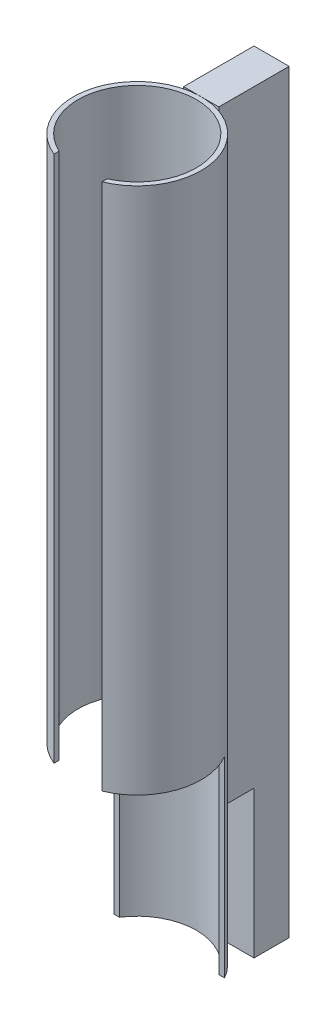
ISO-10303-21;
HEADER;
FILE_DESCRIPTION(('STEP AP214'),'2;1');
FILE_NAME('part.step','',(''),(''),'','','');
FILE_SCHEMA(('AUTOMOTIVE_DESIGN { 1 0 10303 214 1 1 1 1 }'));
ENDSEC;
DATA;
#1=APPLICATION_CONTEXT('core data for automotive mechanical design processes');
#2=APPLICATION_PROTOCOL_DEFINITION('international standard','automotive_design',2000,#1);
#3=PRODUCT_CONTEXT('',#1,'mechanical');
#4=PRODUCT('Part','Part','',(#3));
#5=PRODUCT_RELATED_PRODUCT_CATEGORY('part','',(#4));
#6=PRODUCT_DEFINITION_FORMATION('','',#4);
#7=PRODUCT_DEFINITION_CONTEXT('part definition',#1,'design');
#8=PRODUCT_DEFINITION('design','',#6,#7);
#9=PRODUCT_DEFINITION_SHAPE('','',#8);
#10=(LENGTH_UNIT() NAMED_UNIT(*) SI_UNIT(.MILLI.,.METRE.));
#11=(NAMED_UNIT(*) PLANE_ANGLE_UNIT() SI_UNIT($,.RADIAN.));
#12=(NAMED_UNIT(*) SI_UNIT($,.STERADIAN.) SOLID_ANGLE_UNIT());
#13=UNCERTAINTY_MEASURE_WITH_UNIT(LENGTH_MEASURE(1.E-05),#10,'distance_accuracy_value','');
#14=(GEOMETRIC_REPRESENTATION_CONTEXT(3) GLOBAL_UNCERTAINTY_ASSIGNED_CONTEXT((#13)) GLOBAL_UNIT_ASSIGNED_CONTEXT((#10,
#11,#12)) REPRESENTATION_CONTEXT('',''));
#15=CARTESIAN_POINT('',(0.,0.,0.));
#16=DIRECTION('',(0.,0.,1.));
#17=DIRECTION('',(1.,0.,0.));
#18=AXIS2_PLACEMENT_3D('',#15,#16,#17);
#19=CARTESIAN_POINT('',(11.,70.,-62.));
#20=DIRECTION('',(0.,0.,-1.));
#21=DIRECTION('',(0.,1.,0.));
#22=AXIS2_PLACEMENT_3D('',#19,#20,#21);
#23=PLANE('',#22);
#24=DIRECTION('',(0.,-1.,0.));
#25=VECTOR('',#24,1.);
#26=CARTESIAN_POINT('',(-11.,70.,-62.));
#27=LINE('',#26,#25);
#28=CARTESIAN_POINT('',(-11.,70.,-62.));
#29=VERTEX_POINT('',#28);
#30=CARTESIAN_POINT('',(-11.,-22.,-62.0000000000001));
#31=VERTEX_POINT('',#30);
#32=EDGE_CURVE('E126',#29,#31,#27,.T.);
#33=ORIENTED_EDGE('',*,*,#32,.T.);
#34=DIRECTION('',(-1.,0.,0.));
#35=VECTOR('',#34,1.);
#36=CARTESIAN_POINT('',(11.,-22.,-62.0000000000001));
#37=LINE('',#36,#35);
#38=CARTESIAN_POINT('',(11.,-22.,-62.0000000000001));
#39=VERTEX_POINT('',#38);
#40=EDGE_CURVE('E12',#39,#31,#37,.T.);
#41=ORIENTED_EDGE('',*,*,#40,.F.);
#42=DIRECTION('',(0.,-1.,0.));
#43=VECTOR('',#42,1.);
#44=CARTESIAN_POINT('',(11.,70.,-62.));
#45=LINE('',#44,#43);
#46=CARTESIAN_POINT('',(11.,70.,-62.));
#47=VERTEX_POINT('',#46);
#48=EDGE_CURVE('E136',#47,#39,#45,.T.);
#49=ORIENTED_EDGE('',*,*,#48,.F.);
#50=DIRECTION('',(-1.,0.,0.));
#51=VECTOR('',#50,1.);
#52=CARTESIAN_POINT('',(11.,70.,-62.));
#53=LINE('',#52,#51);
#54=EDGE_CURVE('E122',#47,#29,#53,.T.);
#55=ORIENTED_EDGE('',*,*,#54,.T.);
#56=EDGE_LOOP('',(#33,#41,#49,#55));
#57=FACE_BOUND('',#56,.T.);
#58=ADVANCED_FACE('F42',(#57),#23,.F.);
#59=CARTESIAN_POINT('',(11.,-22.,-62.0000000000001));
#60=DIRECTION('',(0.,1.,0.));
#61=DIRECTION('',(0.,0.,1.));
#62=AXIS2_PLACEMENT_3D('',#59,#60,#61);
#63=PLANE('',#62);
#64=DIRECTION('',(0.,0.,-1.));
#65=VECTOR('',#64,1.);
#66=CARTESIAN_POINT('',(-11.,-22.,-62.0000000000001));
#67=LINE('',#66,#65);
#68=CARTESIAN_POINT('',(-11.,-22.,-84.));
#69=VERTEX_POINT('',#68);
#70=EDGE_CURVE('E129',#31,#69,#67,.T.);
#71=ORIENTED_EDGE('',*,*,#70,.T.);
#72=DIRECTION('',(-1.,0.,0.));
#73=VECTOR('',#72,1.);
#74=CARTESIAN_POINT('',(11.,-22.,-84.));
#75=LINE('',#74,#73);
#76=CARTESIAN_POINT('',(11.,-22.,-84.));
#77=VERTEX_POINT('',#76);
#78=EDGE_CURVE('E50',#77,#69,#75,.T.);
#79=ORIENTED_EDGE('',*,*,#78,.F.);
#80=DIRECTION('',(0.,0.,-1.));
#81=VECTOR('',#80,1.);
#82=CARTESIAN_POINT('',(11.,-22.,-62.0000000000001));
#83=LINE('',#82,#81);
#84=EDGE_CURVE('E95',#39,#77,#83,.T.);
#85=ORIENTED_EDGE('',*,*,#84,.F.);
#86=ORIENTED_EDGE('',*,*,#40,.T.);
#87=EDGE_LOOP('',(#71,#79,#85,#86));
#88=FACE_BOUND('',#87,.T.);
#89=ADVANCED_FACE('F160',(#88),#63,.F.);
#90=CARTESIAN_POINT('',(11.,-22.,-84.));
#91=DIRECTION('',(0.,0.,1.));
#92=DIRECTION('',(1.,0.,0.));
#93=AXIS2_PLACEMENT_3D('',#90,#91,#92);
#94=PLANE('',#93);
#95=DIRECTION('',(0.,1.,0.));
#96=VECTOR('',#95,1.);
#97=CARTESIAN_POINT('',(-11.,-22.,-84.));
#98=LINE('',#97,#96);
#99=CARTESIAN_POINT('',(-11.,450.,-84.));
#100=VERTEX_POINT('',#99);
#101=EDGE_CURVE('E131',#69,#100,#98,.T.);
#102=ORIENTED_EDGE('',*,*,#101,.T.);
#103=DIRECTION('',(-1.,0.,0.));
#104=VECTOR('',#103,1.);
#105=CARTESIAN_POINT('',(11.,450.,-84.));
#106=LINE('',#105,#104);
#107=CARTESIAN_POINT('',(11.,450.,-84.));
#108=VERTEX_POINT('',#107);
#109=EDGE_CURVE('E117',#108,#100,#106,.T.);
#110=ORIENTED_EDGE('',*,*,#109,.F.);
#111=DIRECTION('',(0.,1.,0.));
#112=VECTOR('',#111,1.);
#113=CARTESIAN_POINT('',(11.,-22.,-84.));
#114=LINE('',#113,#112);
#115=EDGE_CURVE('E108',#77,#108,#114,.T.);
#116=ORIENTED_EDGE('',*,*,#115,.F.);
#117=ORIENTED_EDGE('',*,*,#78,.T.);
#118=EDGE_LOOP('',(#102,#110,#116,#117));
#119=FACE_BOUND('',#118,.T.);
#120=ADVANCED_FACE('F142',(#119),#94,.F.);
#121=CARTESIAN_POINT('',(11.,450.,-84.));
#122=DIRECTION('',(0.,-1.,0.));
#123=DIRECTION('',(0.,0.,-1.));
#124=AXIS2_PLACEMENT_3D('',#121,#122,#123);
#125=PLANE('',#124);
#126=DIRECTION('',(0.,0.,1.));
#127=VECTOR('',#126,1.);
#128=CARTESIAN_POINT('',(-11.,450.,-84.));
#129=LINE('',#128,#127);
#130=CARTESIAN_POINT('',(-11.,450.,-40.));
#131=VERTEX_POINT('',#130);
#132=EDGE_CURVE('E116',#100,#131,#129,.T.);
#133=ORIENTED_EDGE('',*,*,#132,.T.);
#134=DIRECTION('',(-1.,0.,0.));
#135=VECTOR('',#134,1.);
#136=CARTESIAN_POINT('',(11.,450.,-40.));
#137=LINE('',#136,#135);
#138=CARTESIAN_POINT('',(11.,450.,-40.));
#139=VERTEX_POINT('',#138);
#140=EDGE_CURVE('E113',#139,#131,#137,.T.);
#141=ORIENTED_EDGE('',*,*,#140,.F.);
#142=DIRECTION('',(0.,0.,1.));
#143=VECTOR('',#142,1.);
#144=CARTESIAN_POINT('',(11.,450.,-84.));
#145=LINE('',#144,#143);
#146=EDGE_CURVE('E102',#108,#139,#145,.T.);
#147=ORIENTED_EDGE('',*,*,#146,.F.);
#148=ORIENTED_EDGE('',*,*,#109,.T.);
#149=EDGE_LOOP('',(#133,#141,#147,#148));
#150=FACE_BOUND('',#149,.T.);
#151=ADVANCED_FACE('F114',(#150),#125,.F.);
#152=CARTESIAN_POINT('',(11.,450.,-40.));
#153=DIRECTION('',(0.,0.,-1.));
#154=DIRECTION('',(0.,1.,0.));
#155=AXIS2_PLACEMENT_3D('',#152,#153,#154);
#156=PLANE('',#155);
#157=DIRECTION('',(0.,-1.,0.));
#158=VECTOR('',#157,1.);
#159=CARTESIAN_POINT('',(-11.,450.,-40.));
#160=LINE('',#159,#158);
#161=CARTESIAN_POINT('',(-11.,70.,-40.));
#162=VERTEX_POINT('',#161);
#163=EDGE_CURVE('E81',#131,#162,#160,.T.);
#164=ORIENTED_EDGE('',*,*,#163,.T.);
#165=DIRECTION('',(-1.,0.,0.));
#166=VECTOR('',#165,1.);
#167=CARTESIAN_POINT('',(11.,70.,-40.));
#168=LINE('',#167,#166);
#169=CARTESIAN_POINT('',(11.,70.,-40.));
#170=VERTEX_POINT('',#169);
#171=EDGE_CURVE('E118',#170,#162,#168,.T.);
#172=ORIENTED_EDGE('',*,*,#171,.F.);
#173=DIRECTION('',(0.,-1.,0.));
#174=VECTOR('',#173,1.);
#175=CARTESIAN_POINT('',(11.,450.,-40.));
#176=LINE('',#175,#174);
#177=EDGE_CURVE('E106',#139,#170,#176,.T.);
#178=ORIENTED_EDGE('',*,*,#177,.F.);
#179=ORIENTED_EDGE('',*,*,#140,.T.);
#180=EDGE_LOOP('',(#164,#172,#178,#179));
#181=FACE_BOUND('',#180,.T.);
#182=ADVANCED_FACE('F120',(#181),#156,.F.);
#183=CARTESIAN_POINT('',(11.,70.,-40.));
#184=DIRECTION('',(0.,1.,0.));
#185=DIRECTION('',(0.,0.,1.));
#186=AXIS2_PLACEMENT_3D('',#183,#184,#185);
#187=PLANE('',#186);
#188=DIRECTION('',(0.,0.,-1.));
#189=VECTOR('',#188,1.);
#190=CARTESIAN_POINT('',(-11.,70.,-40.));
#191=LINE('',#190,#189);
#192=EDGE_CURVE('E87',#162,#29,#191,.T.);
#193=ORIENTED_EDGE('',*,*,#192,.T.);
#194=ORIENTED_EDGE('',*,*,#54,.F.);
#195=DIRECTION('',(0.,0.,-1.));
#196=VECTOR('',#195,1.);
#197=CARTESIAN_POINT('',(11.,70.,-40.));
#198=LINE('',#197,#196);
#199=EDGE_CURVE('E58',#170,#47,#198,.T.);
#200=ORIENTED_EDGE('',*,*,#199,.F.);
#201=ORIENTED_EDGE('',*,*,#171,.T.);
#202=EDGE_LOOP('',(#193,#194,#200,#201));
#203=FACE_BOUND('',#202,.T.);
#204=ADVANCED_FACE('F149',(#203),#187,.F.);
#205=CARTESIAN_POINT('',(11.,0.,0.));
#206=DIRECTION('',(1.,0.,0.));
#207=DIRECTION('',(0.,0.,-1.));
#208=AXIS2_PLACEMENT_3D('',#205,#206,#207);
#209=PLANE('',#208);
#210=ORIENTED_EDGE('',*,*,#48,.T.);
#211=ORIENTED_EDGE('',*,*,#84,.T.);
#212=ORIENTED_EDGE('',*,*,#115,.T.);
#213=ORIENTED_EDGE('',*,*,#146,.T.);
#214=ORIENTED_EDGE('',*,*,#177,.T.);
#215=ORIENTED_EDGE('',*,*,#199,.T.);
#216=EDGE_LOOP('',(#210,#211,#212,#213,#214,#215));
#217=FACE_BOUND('',#216,.T.);
#218=ADVANCED_FACE('F104',(#217),#209,.T.);
#219=CARTESIAN_POINT('',(-11.,0.,0.));
#220=DIRECTION('',(1.,0.,0.));
#221=DIRECTION('',(0.,0.,-1.));
#222=AXIS2_PLACEMENT_3D('',#219,#220,#221);
#223=PLANE('',#222);
#224=ORIENTED_EDGE('',*,*,#32,.F.);
#225=ORIENTED_EDGE('',*,*,#192,.F.);
#226=ORIENTED_EDGE('',*,*,#163,.F.);
#227=ORIENTED_EDGE('',*,*,#132,.F.);
#228=ORIENTED_EDGE('',*,*,#101,.F.);
#229=ORIENTED_EDGE('',*,*,#70,.F.);
#230=EDGE_LOOP('',(#224,#225,#226,#227,#228,#229));
#231=FACE_BOUND('',#230,.T.);
#232=ADVANCED_FACE('F145',(#231),#223,.F.);
#233=CLOSED_SHELL('',(#58,#89,#120,#151,#182,#204,#218,#232));
#234=MANIFOLD_SOLID_BREP('B2',#233);
#235=CARTESIAN_POINT('',(0.,450.,0.));
#236=DIRECTION('',(0.,1.,0.));
#237=DIRECTION('',(0.,0.,1.));
#238=AXIS2_PLACEMENT_3D('',#235,#236,#237);
#239=PLANE('',#238);
#240=CARTESIAN_POINT('',(0.,450.,0.));
#241=DIRECTION('',(0.,1.,0.));
#242=DIRECTION('',(0.,0.,1.));
#243=AXIS2_PLACEMENT_3D('',#240,#241,#242);
#244=CIRCLE('',#243,40.);
#245=CARTESIAN_POINT('',(15.,450.,37.0809924354783));
#246=VERTEX_POINT('',#245);
#247=CARTESIAN_POINT('',(-15.,450.,37.0809924354783));
#248=VERTEX_POINT('',#247);
#249=EDGE_CURVE('E292',#246,#248,#244,.T.);
#250=ORIENTED_EDGE('',*,*,#249,.T.);
#251=DIRECTION('',(0.,0.,-1.));
#252=VECTOR('',#251,1.);
#253=CARTESIAN_POINT('',(-15.,450.,40.));
#254=LINE('',#253,#252);
#255=CARTESIAN_POINT('',(-15.,450.,33.8230690505755));
#256=VERTEX_POINT('',#255);
#257=EDGE_CURVE('E295',#248,#256,#254,.T.);
#258=ORIENTED_EDGE('',*,*,#257,.T.);
#259=CARTESIAN_POINT('',(0.,450.,0.));
#260=DIRECTION('',(0.,1.,0.));
#261=DIRECTION('',(0.,0.,1.));
#262=AXIS2_PLACEMENT_3D('',#259,#260,#261);
#263=CIRCLE('',#262,37.);
#264=CARTESIAN_POINT('',(15.,450.,33.8230690505755));
#265=VERTEX_POINT('',#264);
#266=EDGE_CURVE('E294',#265,#256,#263,.T.);
#267=ORIENTED_EDGE('',*,*,#266,.F.);
#268=DIRECTION('',(0.,0.,-1.));
#269=VECTOR('',#268,1.);
#270=CARTESIAN_POINT('',(15.,450.,40.));
#271=LINE('',#270,#269);
#272=EDGE_CURVE('E282',#246,#265,#271,.T.);
#273=ORIENTED_EDGE('',*,*,#272,.F.);
#274=EDGE_LOOP('',(#250,#258,#267,#273));
#275=FACE_BOUND('',#274,.T.);
#276=ADVANCED_FACE('F217',(#275),#239,.T.);
#277=CARTESIAN_POINT('',(0.,450.,0.));
#278=DIRECTION('',(0.,-1.,0.));
#279=DIRECTION('',(0.,0.,-1.));
#280=AXIS2_PLACEMENT_3D('',#277,#278,#279);
#281=CYLINDRICAL_SURFACE('',#280,40.);
#282=DIRECTION('',(0.,-1.,0.));
#283=VECTOR('',#282,1.);
#284=CARTESIAN_POINT('',(-15.,450.,37.0809924354783));
#285=LINE('',#284,#283);
#286=CARTESIAN_POINT('',(-15.,120.,37.0809924354783));
#287=VERTEX_POINT('',#286);
#288=EDGE_CURVE('E239',#248,#287,#285,.T.);
#289=ORIENTED_EDGE('',*,*,#288,.F.);
#290=ORIENTED_EDGE('',*,*,#249,.F.);
#291=DIRECTION('',(0.,-1.,0.));
#292=VECTOR('',#291,1.);
#293=CARTESIAN_POINT('',(15.,450.,37.0809924354783));
#294=LINE('',#293,#292);
#295=CARTESIAN_POINT('',(15.,120.,37.0809924354783));
#296=VERTEX_POINT('',#295);
#297=EDGE_CURVE('E279',#296,#246,#294,.F.);
#298=ORIENTED_EDGE('',*,*,#297,.F.);
#299=CARTESIAN_POINT('',(0.,120.,0.));
#300=DIRECTION('',(0.,1.,0.));
#301=DIRECTION('',(0.,0.,1.));
#302=AXIS2_PLACEMENT_3D('',#299,#300,#301);
#303=CIRCLE('',#302,40.);
#304=CARTESIAN_POINT('',(34.6410161513776,120.,-20.));
#305=VERTEX_POINT('',#304);
#306=EDGE_CURVE('E337',#296,#305,#303,.T.);
#307=ORIENTED_EDGE('',*,*,#306,.T.);
#308=DIRECTION('',(0.,-1.,0.));
#309=VECTOR('',#308,1.);
#310=CARTESIAN_POINT('',(34.6410161513775,450.,-20.));
#311=LINE('',#310,#309);
#312=CARTESIAN_POINT('',(34.6410161513776,0.,-20.));
#313=VERTEX_POINT('',#312);
#314=EDGE_CURVE('E340',#305,#313,#311,.T.);
#315=ORIENTED_EDGE('',*,*,#314,.T.);
#316=CARTESIAN_POINT('',(0.,0.,0.));
#317=DIRECTION('',(0.,1.,0.));
#318=DIRECTION('',(0.,0.,1.));
#319=AXIS2_PLACEMENT_3D('',#316,#317,#318);
#320=CIRCLE('',#319,40.);
#321=CARTESIAN_POINT('',(-34.6410161513775,0.,-20.));
#322=VERTEX_POINT('',#321);
#323=EDGE_CURVE('E299',#313,#322,#320,.T.);
#324=ORIENTED_EDGE('',*,*,#323,.T.);
#325=DIRECTION('',(0.,-1.,0.));
#326=VECTOR('',#325,1.);
#327=CARTESIAN_POINT('',(-34.6410161513775,450.,-20.));
#328=LINE('',#327,#326);
#329=CARTESIAN_POINT('',(-34.6410161513775,120.,-20.));
#330=VERTEX_POINT('',#329);
#331=EDGE_CURVE('E343',#322,#330,#328,.F.);
#332=ORIENTED_EDGE('',*,*,#331,.T.);
#333=EDGE_CURVE('E336',#330,#287,#303,.T.);
#334=ORIENTED_EDGE('',*,*,#333,.T.);
#335=EDGE_LOOP('',(#289,#290,#298,#307,#315,#324,#332,#334));
#336=FACE_BOUND('',#335,.T.);
#337=ADVANCED_FACE('F219',(#336),#281,.T.);
#338=CARTESIAN_POINT('',(0.,450.,0.));
#339=DIRECTION('',(0.,-1.,0.));
#340=DIRECTION('',(0.,0.,-1.));
#341=AXIS2_PLACEMENT_3D('',#338,#339,#340);
#342=CYLINDRICAL_SURFACE('',#341,37.);
#343=ORIENTED_EDGE('',*,*,#266,.T.);
#344=DIRECTION('',(0.,-1.,0.));
#345=VECTOR('',#344,1.);
#346=CARTESIAN_POINT('',(-15.,450.,33.8230690505755));
#347=LINE('',#346,#345);
#348=CARTESIAN_POINT('',(-15.,120.,33.8230690505755));
#349=VERTEX_POINT('',#348);
#350=EDGE_CURVE('E286',#256,#349,#347,.T.);
#351=ORIENTED_EDGE('',*,*,#350,.T.);
#352=CARTESIAN_POINT('',(0.,120.,0.));
#353=DIRECTION('',(0.,1.,0.));
#354=DIRECTION('',(0.,0.,1.));
#355=AXIS2_PLACEMENT_3D('',#352,#353,#354);
#356=CIRCLE('',#355,37.);
#357=CARTESIAN_POINT('',(-31.1287648325468,120.,-20.));
#358=VERTEX_POINT('',#357);
#359=EDGE_CURVE('E309',#358,#349,#356,.T.);
#360=ORIENTED_EDGE('',*,*,#359,.F.);
#361=DIRECTION('',(0.,-1.,0.));
#362=VECTOR('',#361,1.);
#363=CARTESIAN_POINT('',(-31.1287648325468,450.,-20.));
#364=LINE('',#363,#362);
#365=CARTESIAN_POINT('',(-31.1287648325468,0.,-20.));
#366=VERTEX_POINT('',#365);
#367=EDGE_CURVE('E298',#366,#358,#364,.F.);
#368=ORIENTED_EDGE('',*,*,#367,.F.);
#369=CARTESIAN_POINT('',(0.,0.,0.));
#370=DIRECTION('',(0.,1.,0.));
#371=DIRECTION('',(0.,0.,1.));
#372=AXIS2_PLACEMENT_3D('',#369,#370,#371);
#373=CIRCLE('',#372,37.);
#374=CARTESIAN_POINT('',(31.1287648325468,0.,-20.));
#375=VERTEX_POINT('',#374);
#376=EDGE_CURVE('E306',#375,#366,#373,.T.);
#377=ORIENTED_EDGE('',*,*,#376,.F.);
#378=DIRECTION('',(0.,-1.,0.));
#379=VECTOR('',#378,1.);
#380=CARTESIAN_POINT('',(31.1287648325468,450.,-20.));
#381=LINE('',#380,#379);
#382=CARTESIAN_POINT('',(31.1287648325468,120.,-20.));
#383=VERTEX_POINT('',#382);
#384=EDGE_CURVE('E312',#383,#375,#381,.T.);
#385=ORIENTED_EDGE('',*,*,#384,.F.);
#386=CARTESIAN_POINT('',(15.,120.,33.8230690505755));
#387=VERTEX_POINT('',#386);
#388=EDGE_CURVE('E301',#387,#383,#356,.T.);
#389=ORIENTED_EDGE('',*,*,#388,.F.);
#390=DIRECTION('',(0.,-1.,0.));
#391=VECTOR('',#390,1.);
#392=CARTESIAN_POINT('',(15.,450.,33.8230690505755));
#393=LINE('',#392,#391);
#394=EDGE_CURVE('E232',#387,#265,#393,.F.);
#395=ORIENTED_EDGE('',*,*,#394,.T.);
#396=EDGE_LOOP('',(#343,#351,#360,#368,#377,#385,#389,#395));
#397=FACE_BOUND('',#396,.T.);
#398=ADVANCED_FACE('F334',(#397),#342,.F.);
#399=CARTESIAN_POINT('',(-40.,120.,-20.));
#400=DIRECTION('',(0.,1.,0.));
#401=DIRECTION('',(0.,0.,1.));
#402=AXIS2_PLACEMENT_3D('',#399,#400,#401);
#403=PLANE('',#402);
#404=DIRECTION('',(0.,0.,-1.));
#405=VECTOR('',#404,1.);
#406=CARTESIAN_POINT('',(-15.,120.,-20.));
#407=LINE('',#406,#405);
#408=EDGE_CURVE('E40',#287,#349,#407,.T.);
#409=ORIENTED_EDGE('',*,*,#408,.F.);
#410=ORIENTED_EDGE('',*,*,#333,.F.);
#411=DIRECTION('',(-1.,0.,0.));
#412=VECTOR('',#411,1.);
#413=CARTESIAN_POINT('',(-40.,120.,-20.));
#414=LINE('',#413,#412);
#415=EDGE_CURVE('E345',#358,#330,#414,.T.);
#416=ORIENTED_EDGE('',*,*,#415,.F.);
#417=ORIENTED_EDGE('',*,*,#359,.T.);
#418=EDGE_LOOP('',(#409,#410,#416,#417));
#419=FACE_BOUND('',#418,.T.);
#420=ADVANCED_FACE('F358',(#419),#403,.F.);
#421=DIRECTION('',(0.,0.,1.));
#422=VECTOR('',#421,1.);
#423=CARTESIAN_POINT('',(15.,120.,-20.));
#424=LINE('',#423,#422);
#425=EDGE_CURVE('E225',#387,#296,#424,.T.);
#426=ORIENTED_EDGE('',*,*,#425,.F.);
#427=ORIENTED_EDGE('',*,*,#388,.T.);
#428=EDGE_CURVE('E322',#305,#383,#414,.T.);
#429=ORIENTED_EDGE('',*,*,#428,.F.);
#430=ORIENTED_EDGE('',*,*,#306,.F.);
#431=EDGE_LOOP('',(#426,#427,#429,#430));
#432=FACE_BOUND('',#431,.T.);
#433=ADVANCED_FACE('F353',(#432),#403,.F.);
#434=CARTESIAN_POINT('',(0.,0.,0.));
#435=DIRECTION('',(0.,1.,0.));
#436=DIRECTION('',(0.,0.,1.));
#437=AXIS2_PLACEMENT_3D('',#434,#435,#436);
#438=PLANE('',#437);
#439=ORIENTED_EDGE('',*,*,#323,.F.);
#440=DIRECTION('',(1.,0.,0.));
#441=VECTOR('',#440,1.);
#442=CARTESIAN_POINT('',(-40.,0.,-20.));
#443=LINE('',#442,#441);
#444=EDGE_CURVE('E319',#375,#313,#443,.T.);
#445=ORIENTED_EDGE('',*,*,#444,.F.);
#446=ORIENTED_EDGE('',*,*,#376,.T.);
#447=EDGE_CURVE('E331',#322,#366,#443,.T.);
#448=ORIENTED_EDGE('',*,*,#447,.F.);
#449=EDGE_LOOP('',(#439,#445,#446,#448));
#450=FACE_BOUND('',#449,.T.);
#451=ADVANCED_FACE('F329',(#450),#438,.F.);
#452=CARTESIAN_POINT('',(0.,0.,-20.));
#453=DIRECTION('',(0.,0.,-1.));
#454=DIRECTION('',(-1.,0.,0.));
#455=AXIS2_PLACEMENT_3D('',#452,#453,#454);
#456=PLANE('',#455);
#457=ORIENTED_EDGE('',*,*,#428,.T.);
#458=ORIENTED_EDGE('',*,*,#384,.T.);
#459=ORIENTED_EDGE('',*,*,#444,.T.);
#460=ORIENTED_EDGE('',*,*,#314,.F.);
#461=EDGE_LOOP('',(#457,#458,#459,#460));
#462=FACE_BOUND('',#461,.T.);
#463=ADVANCED_FACE('F317',(#462),#456,.F.);
#464=ORIENTED_EDGE('',*,*,#447,.T.);
#465=ORIENTED_EDGE('',*,*,#367,.T.);
#466=ORIENTED_EDGE('',*,*,#415,.T.);
#467=ORIENTED_EDGE('',*,*,#331,.F.);
#468=EDGE_LOOP('',(#464,#465,#466,#467));
#469=FACE_BOUND('',#468,.T.);
#470=ADVANCED_FACE('F355',(#469),#456,.F.);
#471=CARTESIAN_POINT('',(15.,450.,40.));
#472=DIRECTION('',(-1.,0.,0.));
#473=DIRECTION('',(0.,-1.,0.));
#474=AXIS2_PLACEMENT_3D('',#471,#472,#473);
#475=PLANE('',#474);
#476=ORIENTED_EDGE('',*,*,#297,.T.);
#477=ORIENTED_EDGE('',*,*,#272,.T.);
#478=ORIENTED_EDGE('',*,*,#394,.F.);
#479=ORIENTED_EDGE('',*,*,#425,.T.);
#480=EDGE_LOOP('',(#476,#477,#478,#479));
#481=FACE_BOUND('',#480,.T.);
#482=ADVANCED_FACE('F281',(#481),#475,.T.);
#483=CARTESIAN_POINT('',(-15.,450.,40.));
#484=DIRECTION('',(1.,0.,0.));
#485=DIRECTION('',(0.,1.,0.));
#486=AXIS2_PLACEMENT_3D('',#483,#484,#485);
#487=PLANE('',#486);
#488=ORIENTED_EDGE('',*,*,#288,.T.);
#489=ORIENTED_EDGE('',*,*,#408,.T.);
#490=ORIENTED_EDGE('',*,*,#350,.F.);
#491=ORIENTED_EDGE('',*,*,#257,.F.);
#492=EDGE_LOOP('',(#488,#489,#490,#491));
#493=FACE_BOUND('',#492,.T.);
#494=ADVANCED_FACE('F359',(#493),#487,.T.);
#495=CLOSED_SHELL('',(#276,#337,#398,#420,#433,#451,#463,#470,#482,#494));
#496=MANIFOLD_SOLID_BREP('B6',#495);
#497=ADVANCED_BREP_SHAPE_REPRESENTATION('',(#18,#234,#496),#14);
#498=SHAPE_DEFINITION_REPRESENTATION(#9,#497);
ENDSEC;
END-ISO-10303-21;
